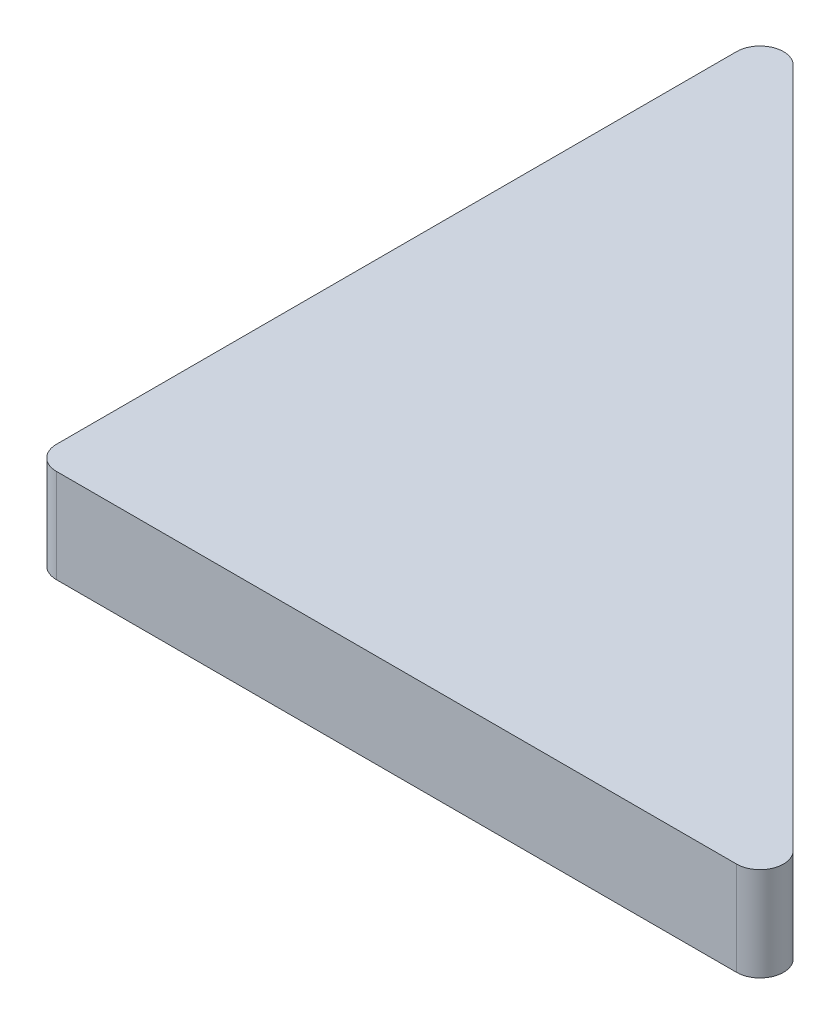
ISO-10303-21;
HEADER;
FILE_DESCRIPTION(('STEP AP214'),'2;1');
FILE_NAME('part.step','',(''),(''),'','','');
FILE_SCHEMA(('AUTOMOTIVE_DESIGN { 1 0 10303 214 1 1 1 1 }'));
ENDSEC;
DATA;
#1=APPLICATION_CONTEXT('core data for automotive mechanical design processes');
#2=APPLICATION_PROTOCOL_DEFINITION('international standard','automotive_design',2000,#1);
#3=PRODUCT_CONTEXT('',#1,'mechanical');
#4=PRODUCT('Part','Part','',(#3));
#5=PRODUCT_RELATED_PRODUCT_CATEGORY('part','',(#4));
#6=PRODUCT_DEFINITION_FORMATION('','',#4);
#7=PRODUCT_DEFINITION_CONTEXT('part definition',#1,'design');
#8=PRODUCT_DEFINITION('design','',#6,#7);
#9=PRODUCT_DEFINITION_SHAPE('','',#8);
#10=(LENGTH_UNIT() NAMED_UNIT(*) SI_UNIT(.MILLI.,.METRE.));
#11=(NAMED_UNIT(*) PLANE_ANGLE_UNIT() SI_UNIT($,.RADIAN.));
#12=(NAMED_UNIT(*) SI_UNIT($,.STERADIAN.) SOLID_ANGLE_UNIT());
#13=UNCERTAINTY_MEASURE_WITH_UNIT(LENGTH_MEASURE(1.E-05),#10,'distance_accuracy_value','');
#14=(GEOMETRIC_REPRESENTATION_CONTEXT(3) GLOBAL_UNCERTAINTY_ASSIGNED_CONTEXT((#13)) GLOBAL_UNIT_ASSIGNED_CONTEXT((#10,
#11,#12)) REPRESENTATION_CONTEXT('',''));
#15=CARTESIAN_POINT('',(0.,0.,0.));
#16=DIRECTION('',(0.,0.,1.));
#17=DIRECTION('',(1.,0.,0.));
#18=AXIS2_PLACEMENT_3D('',#15,#16,#17);
#19=CARTESIAN_POINT('',(2.5,10.,-2.5));
#20=DIRECTION('',(0.,-1.,0.));
#21=DIRECTION('',(0.,0.,-1.));
#22=AXIS2_PLACEMENT_3D('',#19,#20,#21);
#23=CYLINDRICAL_SURFACE('',#22,2.5);
#24=CARTESIAN_POINT('',(2.5,0.,-2.5));
#25=DIRECTION('',(0.,-1.,0.));
#26=DIRECTION('',(0.,0.,-1.));
#27=AXIS2_PLACEMENT_3D('',#24,#25,#26);
#28=CIRCLE('',#27,2.5);
#29=CARTESIAN_POINT('',(2.5,0.,0.));
#30=VERTEX_POINT('',#29);
#31=CARTESIAN_POINT('',(0.,0.,-2.5));
#32=VERTEX_POINT('',#31);
#33=EDGE_CURVE('E133',#30,#32,#28,.T.);
#34=ORIENTED_EDGE('',*,*,#33,.F.);
#35=DIRECTION('',(0.,-1.,0.));
#36=VECTOR('',#35,1.);
#37=CARTESIAN_POINT('',(2.5,10.,0.));
#38=LINE('',#37,#36);
#39=CARTESIAN_POINT('',(2.5,10.,0.));
#40=VERTEX_POINT('',#39);
#41=EDGE_CURVE('E12',#40,#30,#38,.T.);
#42=ORIENTED_EDGE('',*,*,#41,.F.);
#43=CARTESIAN_POINT('',(2.5,10.,-2.5));
#44=DIRECTION('',(0.,-1.,0.));
#45=DIRECTION('',(0.,0.,-1.));
#46=AXIS2_PLACEMENT_3D('',#43,#44,#45);
#47=CIRCLE('',#46,2.5);
#48=CARTESIAN_POINT('',(0.,10.,-2.5));
#49=VERTEX_POINT('',#48);
#50=EDGE_CURVE('E146',#40,#49,#47,.T.);
#51=ORIENTED_EDGE('',*,*,#50,.T.);
#52=DIRECTION('',(0.,-1.,0.));
#53=VECTOR('',#52,1.);
#54=CARTESIAN_POINT('',(0.,10.,-2.5));
#55=LINE('',#54,#53);
#56=EDGE_CURVE('E39',#49,#32,#55,.T.);
#57=ORIENTED_EDGE('',*,*,#56,.T.);
#58=EDGE_LOOP('',(#34,#42,#51,#57));
#59=FACE_BOUND('',#58,.T.);
#60=ADVANCED_FACE('F36',(#59),#23,.T.);
#61=CARTESIAN_POINT('',(2.5,10.,0.));
#62=DIRECTION('',(0.,0.,-1.));
#63=DIRECTION('',(-1.,0.,0.));
#64=AXIS2_PLACEMENT_3D('',#61,#62,#63);
#65=PLANE('',#64);
#66=DIRECTION('',(1.,0.,0.));
#67=VECTOR('',#66,1.);
#68=CARTESIAN_POINT('',(2.5,0.,0.));
#69=LINE('',#68,#67);
#70=CARTESIAN_POINT('',(74.995132867957,0.,0.));
#71=VERTEX_POINT('',#70);
#72=EDGE_CURVE('E145',#30,#71,#69,.T.);
#73=ORIENTED_EDGE('',*,*,#72,.T.);
#74=DIRECTION('',(0.,-1.,0.));
#75=VECTOR('',#74,1.);
#76=CARTESIAN_POINT('',(74.995132867957,10.,0.));
#77=LINE('',#76,#75);
#78=CARTESIAN_POINT('',(74.995132867957,10.,0.));
#79=VERTEX_POINT('',#78);
#80=EDGE_CURVE('E45',#79,#71,#77,.T.);
#81=ORIENTED_EDGE('',*,*,#80,.F.);
#82=DIRECTION('',(1.,0.,0.));
#83=VECTOR('',#82,1.);
#84=CARTESIAN_POINT('',(2.5,10.,0.));
#85=LINE('',#84,#83);
#86=EDGE_CURVE('E110',#40,#79,#85,.T.);
#87=ORIENTED_EDGE('',*,*,#86,.F.);
#88=ORIENTED_EDGE('',*,*,#41,.T.);
#89=EDGE_LOOP('',(#73,#81,#87,#88));
#90=FACE_BOUND('',#89,.T.);
#91=ADVANCED_FACE('F155',(#90),#65,.F.);
#92=CARTESIAN_POINT('',(74.995132867957,10.,-2.5));
#93=DIRECTION('',(0.,-1.,0.));
#94=DIRECTION('',(0.,0.,-1.));
#95=AXIS2_PLACEMENT_3D('',#92,#93,#94);
#96=CYLINDRICAL_SURFACE('',#95,2.5);
#97=CARTESIAN_POINT('',(74.995132867957,0.,-2.5));
#98=DIRECTION('',(0.,-1.,0.));
#99=DIRECTION('',(0.,0.,-1.));
#100=AXIS2_PLACEMENT_3D('',#97,#98,#99);
#101=CIRCLE('',#100,2.5);
#102=CARTESIAN_POINT('',(76.7628998209234,0.,-4.26776695296636));
#103=VERTEX_POINT('',#102);
#104=EDGE_CURVE('E98',#103,#71,#101,.T.);
#105=ORIENTED_EDGE('',*,*,#104,.F.);
#106=DIRECTION('',(0.,-1.,0.));
#107=VECTOR('',#106,1.);
#108=CARTESIAN_POINT('',(76.7628998209234,10.,-4.26776695296636));
#109=LINE('',#108,#107);
#110=CARTESIAN_POINT('',(76.7628998209234,10.,-4.26776695296636));
#111=VERTEX_POINT('',#110);
#112=EDGE_CURVE('E93',#111,#103,#109,.T.);
#113=ORIENTED_EDGE('',*,*,#112,.F.);
#114=CARTESIAN_POINT('',(74.995132867957,10.,-2.5));
#115=DIRECTION('',(0.,-1.,0.));
#116=DIRECTION('',(0.,0.,-1.));
#117=AXIS2_PLACEMENT_3D('',#114,#115,#116);
#118=CIRCLE('',#117,2.5);
#119=EDGE_CURVE('E96',#111,#79,#118,.T.);
#120=ORIENTED_EDGE('',*,*,#119,.T.);
#121=ORIENTED_EDGE('',*,*,#80,.T.);
#122=EDGE_LOOP('',(#105,#113,#120,#121));
#123=FACE_BOUND('',#122,.T.);
#124=ADVANCED_FACE('F95',(#123),#96,.T.);
#125=CARTESIAN_POINT('',(4.26776695296637,10.,-76.7628998209236));
#126=DIRECTION('',(0.707106781186549,0.,-0.707106781186546));
#127=DIRECTION('',(-0.707106781186546,0.,-0.707106781186549));
#128=AXIS2_PLACEMENT_3D('',#125,#126,#127);
#129=PLANE('',#128);
#130=DIRECTION('',(0.707106781186546,0.,0.707106781186549));
#131=VECTOR('',#130,1.);
#132=CARTESIAN_POINT('',(4.26776695296637,0.,-76.7628998209236));
#133=LINE('',#132,#131);
#134=CARTESIAN_POINT('',(4.26776695296637,0.,-76.7628998209236));
#135=VERTEX_POINT('',#134);
#136=EDGE_CURVE('E142',#135,#103,#133,.T.);
#137=ORIENTED_EDGE('',*,*,#136,.F.);
#138=DIRECTION('',(0.,-1.,0.));
#139=VECTOR('',#138,1.);
#140=CARTESIAN_POINT('',(4.26776695296637,10.,-76.7628998209236));
#141=LINE('',#140,#139);
#142=CARTESIAN_POINT('',(4.26776695296637,10.,-76.7628998209236));
#143=VERTEX_POINT('',#142);
#144=EDGE_CURVE('E103',#143,#135,#141,.T.);
#145=ORIENTED_EDGE('',*,*,#144,.F.);
#146=DIRECTION('',(0.707106781186546,0.,0.707106781186549));
#147=VECTOR('',#146,1.);
#148=CARTESIAN_POINT('',(4.26776695296637,10.,-76.7628998209236));
#149=LINE('',#148,#147);
#150=EDGE_CURVE('E109',#143,#111,#149,.T.);
#151=ORIENTED_EDGE('',*,*,#150,.T.);
#152=ORIENTED_EDGE('',*,*,#112,.T.);
#153=EDGE_LOOP('',(#137,#145,#151,#152));
#154=FACE_BOUND('',#153,.T.);
#155=ADVANCED_FACE('F113',(#154),#129,.T.);
#156=CARTESIAN_POINT('',(2.5,10.,-74.9951328679572));
#157=DIRECTION('',(0.,-1.,0.));
#158=DIRECTION('',(0.,0.,-1.));
#159=AXIS2_PLACEMENT_3D('',#156,#157,#158);
#160=CYLINDRICAL_SURFACE('',#159,2.5);
#161=CARTESIAN_POINT('',(2.5,0.,-74.9951328679572));
#162=DIRECTION('',(0.,1.,0.));
#163=DIRECTION('',(0.,0.,1.));
#164=AXIS2_PLACEMENT_3D('',#161,#162,#163);
#165=CIRCLE('',#164,2.5);
#166=CARTESIAN_POINT('',(0.,0.,-74.9951328679572));
#167=VERTEX_POINT('',#166);
#168=EDGE_CURVE('E139',#135,#167,#165,.T.);
#169=ORIENTED_EDGE('',*,*,#168,.T.);
#170=DIRECTION('',(0.,-1.,0.));
#171=VECTOR('',#170,1.);
#172=CARTESIAN_POINT('',(0.,10.,-74.9951328679572));
#173=LINE('',#172,#171);
#174=CARTESIAN_POINT('',(0.,10.,-74.9951328679572));
#175=VERTEX_POINT('',#174);
#176=EDGE_CURVE('E149',#175,#167,#173,.T.);
#177=ORIENTED_EDGE('',*,*,#176,.F.);
#178=CARTESIAN_POINT('',(2.5,10.,-74.9951328679572));
#179=DIRECTION('',(0.,1.,0.));
#180=DIRECTION('',(0.,0.,1.));
#181=AXIS2_PLACEMENT_3D('',#178,#179,#180);
#182=CIRCLE('',#181,2.5);
#183=EDGE_CURVE('E116',#143,#175,#182,.T.);
#184=ORIENTED_EDGE('',*,*,#183,.F.);
#185=ORIENTED_EDGE('',*,*,#144,.T.);
#186=EDGE_LOOP('',(#169,#177,#184,#185));
#187=FACE_BOUND('',#186,.T.);
#188=ADVANCED_FACE('F161',(#187),#160,.T.);
#189=CARTESIAN_POINT('',(0.,10.,-2.5));
#190=DIRECTION('',(-1.,0.,0.));
#191=DIRECTION('',(0.,0.,1.));
#192=AXIS2_PLACEMENT_3D('',#189,#190,#191);
#193=PLANE('',#192);
#194=DIRECTION('',(0.,0.,-1.));
#195=VECTOR('',#194,1.);
#196=CARTESIAN_POINT('',(0.,0.,-2.5));
#197=LINE('',#196,#195);
#198=EDGE_CURVE('E136',#32,#167,#197,.T.);
#199=ORIENTED_EDGE('',*,*,#198,.F.);
#200=ORIENTED_EDGE('',*,*,#56,.F.);
#201=DIRECTION('',(0.,0.,-1.));
#202=VECTOR('',#201,1.);
#203=CARTESIAN_POINT('',(0.,10.,-2.5));
#204=LINE('',#203,#202);
#205=EDGE_CURVE('E119',#49,#175,#204,.T.);
#206=ORIENTED_EDGE('',*,*,#205,.T.);
#207=ORIENTED_EDGE('',*,*,#176,.T.);
#208=EDGE_LOOP('',(#199,#200,#206,#207));
#209=FACE_BOUND('',#208,.T.);
#210=ADVANCED_FACE('F151',(#209),#193,.T.);
#211=CARTESIAN_POINT('',(2.5,10.,-2.5));
#212=DIRECTION('',(0.,-1.,0.));
#213=DIRECTION('',(0.,0.,-1.));
#214=AXIS2_PLACEMENT_3D('',#211,#212,#213);
#215=PLANE('',#214);
#216=ORIENTED_EDGE('',*,*,#50,.F.);
#217=ORIENTED_EDGE('',*,*,#86,.T.);
#218=ORIENTED_EDGE('',*,*,#119,.F.);
#219=ORIENTED_EDGE('',*,*,#150,.F.);
#220=ORIENTED_EDGE('',*,*,#183,.T.);
#221=ORIENTED_EDGE('',*,*,#205,.F.);
#222=EDGE_LOOP('',(#216,#217,#218,#219,#220,#221));
#223=FACE_BOUND('',#222,.T.);
#224=ADVANCED_FACE('F108',(#223),#215,.F.);
#225=CARTESIAN_POINT('',(2.5,0.,-2.5));
#226=DIRECTION('',(0.,-1.,0.));
#227=DIRECTION('',(0.,0.,-1.));
#228=AXIS2_PLACEMENT_3D('',#225,#226,#227);
#229=PLANE('',#228);
#230=ORIENTED_EDGE('',*,*,#33,.T.);
#231=ORIENTED_EDGE('',*,*,#198,.T.);
#232=ORIENTED_EDGE('',*,*,#168,.F.);
#233=ORIENTED_EDGE('',*,*,#136,.T.);
#234=ORIENTED_EDGE('',*,*,#104,.T.);
#235=ORIENTED_EDGE('',*,*,#72,.F.);
#236=EDGE_LOOP('',(#230,#231,#232,#233,#234,#235));
#237=FACE_BOUND('',#236,.T.);
#238=ADVANCED_FACE('F154',(#237),#229,.T.);
#239=CLOSED_SHELL('',(#60,#91,#124,#155,#188,#210,#224,#238));
#240=MANIFOLD_SOLID_BREP('B2',#239);
#241=ADVANCED_BREP_SHAPE_REPRESENTATION('',(#18,#240),#14);
#242=SHAPE_DEFINITION_REPRESENTATION(#9,#241);
ENDSEC;
END-ISO-10303-21;
